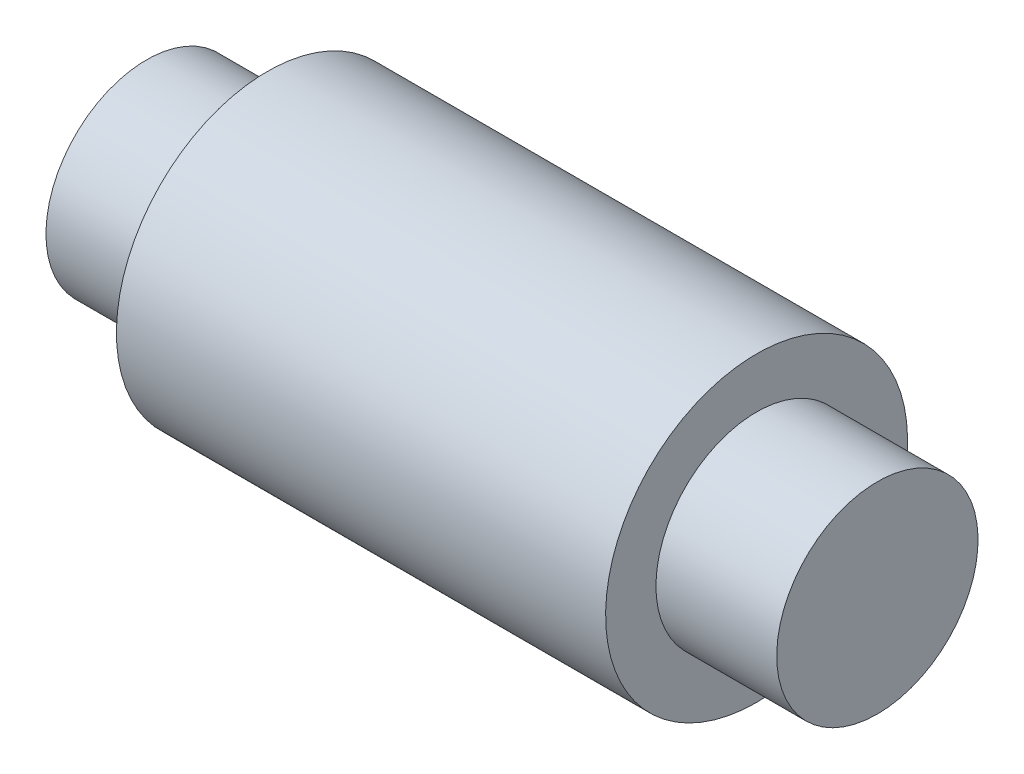
ISO-10303-21;
HEADER;
FILE_DESCRIPTION(('STEP AP214'),'2;1');
FILE_NAME('part.step','',(''),(''),'','','');
FILE_SCHEMA(('AUTOMOTIVE_DESIGN { 1 0 10303 214 1 1 1 1 }'));
ENDSEC;
DATA;
#1=APPLICATION_CONTEXT('core data for automotive mechanical design processes');
#2=APPLICATION_PROTOCOL_DEFINITION('international standard','automotive_design',2000,#1);
#3=PRODUCT_CONTEXT('',#1,'mechanical');
#4=PRODUCT('Part','Part','',(#3));
#5=PRODUCT_RELATED_PRODUCT_CATEGORY('part','',(#4));
#6=PRODUCT_DEFINITION_FORMATION('','',#4);
#7=PRODUCT_DEFINITION_CONTEXT('part definition',#1,'design');
#8=PRODUCT_DEFINITION('design','',#6,#7);
#9=PRODUCT_DEFINITION_SHAPE('','',#8);
#10=(LENGTH_UNIT() NAMED_UNIT(*) SI_UNIT(.MILLI.,.METRE.));
#11=(NAMED_UNIT(*) PLANE_ANGLE_UNIT() SI_UNIT($,.RADIAN.));
#12=(NAMED_UNIT(*) SI_UNIT($,.STERADIAN.) SOLID_ANGLE_UNIT());
#13=UNCERTAINTY_MEASURE_WITH_UNIT(LENGTH_MEASURE(1.E-05),#10,'distance_accuracy_value','');
#14=(GEOMETRIC_REPRESENTATION_CONTEXT(3) GLOBAL_UNCERTAINTY_ASSIGNED_CONTEXT((#13)) GLOBAL_UNIT_ASSIGNED_CONTEXT((#10,
#11,#12)) REPRESENTATION_CONTEXT('',''));
#15=CARTESIAN_POINT('',(0.,0.,0.));
#16=DIRECTION('',(0.,0.,1.));
#17=DIRECTION('',(1.,0.,0.));
#18=AXIS2_PLACEMENT_3D('',#15,#16,#17);
#19=CARTESIAN_POINT('',(0.,-10.,0.));
#20=DIRECTION('',(-1.,0.,0.));
#21=DIRECTION('',(0.,-1.,0.));
#22=AXIS2_PLACEMENT_3D('',#19,#20,#21);
#23=CYLINDRICAL_SURFACE('',#22,10.);
#24=CARTESIAN_POINT('',(0.,-10.,0.));
#25=DIRECTION('',(-1.,0.,0.));
#26=DIRECTION('',(0.,-1.,0.));
#27=AXIS2_PLACEMENT_3D('',#24,#25,#26);
#28=CIRCLE('',#27,10.);
#29=CARTESIAN_POINT('',(0.,-20.,0.));
#30=VERTEX_POINT('',#29);
#31=EDGE_CURVE('E10',#30,#30,#28,.T.);
#32=ORIENTED_EDGE('',*,*,#31,.F.);
#33=EDGE_LOOP('',(#32));
#34=FACE_BOUND('',#33,.T.);
#35=CARTESIAN_POINT('',(12.,-10.,0.));
#36=DIRECTION('',(-1.,0.,0.));
#37=DIRECTION('',(0.,-1.,0.));
#38=AXIS2_PLACEMENT_3D('',#35,#36,#37);
#39=CIRCLE('',#38,10.);
#40=CARTESIAN_POINT('',(12.,-20.,0.));
#41=VERTEX_POINT('',#40);
#42=EDGE_CURVE('E54',#41,#41,#39,.T.);
#43=ORIENTED_EDGE('',*,*,#42,.T.);
#44=EDGE_LOOP('',(#43));
#45=FACE_BOUND('',#44,.T.);
#46=ADVANCED_FACE('F32',(#34,#45),#23,.T.);
#47=CARTESIAN_POINT('',(0.,0.,0.));
#48=DIRECTION('',(1.,0.,0.));
#49=DIRECTION('',(0.,1.,0.));
#50=AXIS2_PLACEMENT_3D('',#47,#48,#49);
#51=PLANE('',#50);
#52=ORIENTED_EDGE('',*,*,#31,.T.);
#53=EDGE_LOOP('',(#52));
#54=FACE_BOUND('',#53,.T.);
#55=ADVANCED_FACE('F84',(#54),#51,.F.);
#56=CARTESIAN_POINT('',(72.6,-10.,0.));
#57=DIRECTION('',(-1.,0.,0.));
#58=DIRECTION('',(0.,-1.,0.));
#59=AXIS2_PLACEMENT_3D('',#56,#57,#58);
#60=PLANE('',#59);
#61=CARTESIAN_POINT('',(72.6,-10.,0.));
#62=DIRECTION('',(-1.,0.,0.));
#63=DIRECTION('',(0.,-1.,0.));
#64=AXIS2_PLACEMENT_3D('',#61,#62,#63);
#65=CIRCLE('',#64,10.);
#66=CARTESIAN_POINT('',(72.6,-20.,0.));
#67=VERTEX_POINT('',#66);
#68=EDGE_CURVE('E38',#67,#67,#65,.T.);
#69=ORIENTED_EDGE('',*,*,#68,.F.);
#70=EDGE_LOOP('',(#69));
#71=FACE_BOUND('',#70,.T.);
#72=ADVANCED_FACE('F79',(#71),#60,.F.);
#73=CARTESIAN_POINT('',(0.,-10.,0.));
#74=DIRECTION('',(-1.,0.,0.));
#75=DIRECTION('',(0.,-1.,0.));
#76=AXIS2_PLACEMENT_3D('',#73,#74,#75);
#77=CYLINDRICAL_SURFACE('',#76,10.);
#78=CARTESIAN_POINT('',(60.6,-10.,0.));
#79=DIRECTION('',(-1.,0.,0.));
#80=DIRECTION('',(0.,-1.,0.));
#81=AXIS2_PLACEMENT_3D('',#78,#79,#80);
#82=CIRCLE('',#81,10.);
#83=CARTESIAN_POINT('',(60.6,-20.,0.));
#84=VERTEX_POINT('',#83);
#85=EDGE_CURVE('E42',#84,#84,#82,.T.);
#86=ORIENTED_EDGE('',*,*,#85,.F.);
#87=EDGE_LOOP('',(#86));
#88=FACE_BOUND('',#87,.T.);
#89=ORIENTED_EDGE('',*,*,#68,.T.);
#90=EDGE_LOOP('',(#89));
#91=FACE_BOUND('',#90,.T.);
#92=ADVANCED_FACE('F74',(#88,#91),#77,.T.);
#93=CARTESIAN_POINT('',(60.6,0.,0.));
#94=DIRECTION('',(-1.,0.,0.));
#95=DIRECTION('',(0.,-1.,0.));
#96=AXIS2_PLACEMENT_3D('',#93,#94,#95);
#97=PLANE('',#96);
#98=CARTESIAN_POINT('',(60.6,-10.,0.));
#99=DIRECTION('',(-1.,0.,0.));
#100=DIRECTION('',(0.,-1.,0.));
#101=AXIS2_PLACEMENT_3D('',#98,#99,#100);
#102=CIRCLE('',#101,15.);
#103=CARTESIAN_POINT('',(60.6,-25.,0.));
#104=VERTEX_POINT('',#103);
#105=EDGE_CURVE('E46',#104,#104,#102,.T.);
#106=ORIENTED_EDGE('',*,*,#105,.F.);
#107=EDGE_LOOP('',(#106));
#108=FACE_BOUND('',#107,.T.);
#109=ORIENTED_EDGE('',*,*,#85,.T.);
#110=EDGE_LOOP('',(#109));
#111=FACE_BOUND('',#110,.T.);
#112=ADVANCED_FACE('F68',(#108,#111),#97,.F.);
#113=CARTESIAN_POINT('',(0.,-10.,0.));
#114=DIRECTION('',(-1.,0.,0.));
#115=DIRECTION('',(0.,-1.,0.));
#116=AXIS2_PLACEMENT_3D('',#113,#114,#115);
#117=CYLINDRICAL_SURFACE('',#116,15.);
#118=CARTESIAN_POINT('',(12.,-10.,0.));
#119=DIRECTION('',(-1.,0.,0.));
#120=DIRECTION('',(0.,-1.,0.));
#121=AXIS2_PLACEMENT_3D('',#118,#119,#120);
#122=CIRCLE('',#121,15.);
#123=CARTESIAN_POINT('',(12.,-25.,0.));
#124=VERTEX_POINT('',#123);
#125=EDGE_CURVE('E51',#124,#124,#122,.T.);
#126=ORIENTED_EDGE('',*,*,#125,.F.);
#127=EDGE_LOOP('',(#126));
#128=FACE_BOUND('',#127,.T.);
#129=ORIENTED_EDGE('',*,*,#105,.T.);
#130=EDGE_LOOP('',(#129));
#131=FACE_BOUND('',#130,.T.);
#132=ADVANCED_FACE('F62',(#128,#131),#117,.T.);
#133=CARTESIAN_POINT('',(12.,4.99999999999999,0.));
#134=DIRECTION('',(1.,0.,0.));
#135=DIRECTION('',(0.,1.,0.));
#136=AXIS2_PLACEMENT_3D('',#133,#134,#135);
#137=PLANE('',#136);
#138=ORIENTED_EDGE('',*,*,#42,.F.);
#139=EDGE_LOOP('',(#138));
#140=FACE_BOUND('',#139,.T.);
#141=ORIENTED_EDGE('',*,*,#125,.T.);
#142=EDGE_LOOP('',(#141));
#143=FACE_BOUND('',#142,.T.);
#144=ADVANCED_FACE('F59',(#140,#143),#137,.F.);
#145=CLOSED_SHELL('',(#46,#55,#72,#92,#112,#132,#144));
#146=MANIFOLD_SOLID_BREP('B2',#145);
#147=ADVANCED_BREP_SHAPE_REPRESENTATION('',(#18,#146),#14);
#148=SHAPE_DEFINITION_REPRESENTATION(#9,#147);
ENDSEC;
END-ISO-10303-21;
